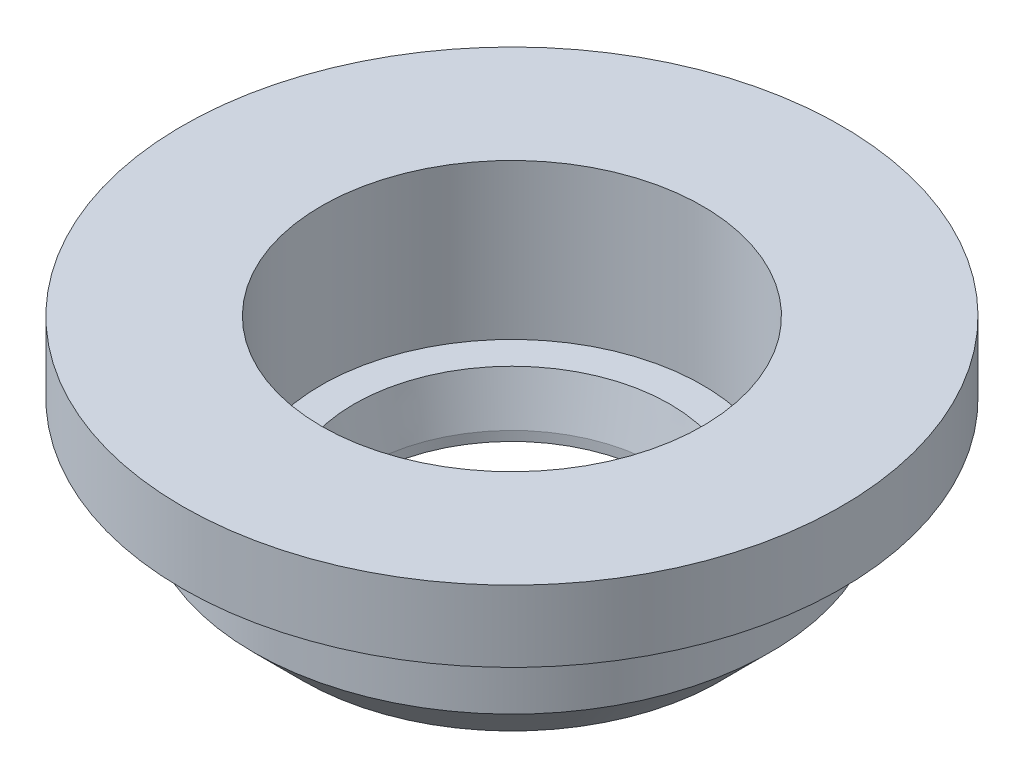
ISO-10303-21;
HEADER;
FILE_DESCRIPTION(('STEP AP214'),'2;1');
FILE_NAME('part.step','',(''),(''),'','','');
FILE_SCHEMA(('AUTOMOTIVE_DESIGN { 1 0 10303 214 1 1 1 1 }'));
ENDSEC;
DATA;
#1=APPLICATION_CONTEXT('core data for automotive mechanical design processes');
#2=APPLICATION_PROTOCOL_DEFINITION('international standard','automotive_design',2000,#1);
#3=PRODUCT_CONTEXT('',#1,'mechanical');
#4=PRODUCT('Part','Part','',(#3));
#5=PRODUCT_RELATED_PRODUCT_CATEGORY('part','',(#4));
#6=PRODUCT_DEFINITION_FORMATION('','',#4);
#7=PRODUCT_DEFINITION_CONTEXT('part definition',#1,'design');
#8=PRODUCT_DEFINITION('design','',#6,#7);
#9=PRODUCT_DEFINITION_SHAPE('','',#8);
#10=(LENGTH_UNIT() NAMED_UNIT(*) SI_UNIT(.MILLI.,.METRE.));
#11=(NAMED_UNIT(*) PLANE_ANGLE_UNIT() SI_UNIT($,.RADIAN.));
#12=(NAMED_UNIT(*) SI_UNIT($,.STERADIAN.) SOLID_ANGLE_UNIT());
#13=UNCERTAINTY_MEASURE_WITH_UNIT(LENGTH_MEASURE(1.E-05),#10,'distance_accuracy_value','');
#14=(GEOMETRIC_REPRESENTATION_CONTEXT(3) GLOBAL_UNCERTAINTY_ASSIGNED_CONTEXT((#13)) GLOBAL_UNIT_ASSIGNED_CONTEXT((#10,
#11,#12)) REPRESENTATION_CONTEXT('',''));
#15=CARTESIAN_POINT('',(0.,0.,0.));
#16=DIRECTION('',(0.,0.,1.));
#17=DIRECTION('',(1.,0.,0.));
#18=AXIS2_PLACEMENT_3D('',#15,#16,#17);
#19=CARTESIAN_POINT('',(0.,10.4485954216317,0.));
#20=DIRECTION('',(0.,1.,0.));
#21=DIRECTION('',(0.,0.,1.));
#22=AXIS2_PLACEMENT_3D('',#19,#20,#21);
#23=CYLINDRICAL_SURFACE('',#22,11.7475);
#24=CARTESIAN_POINT('',(0.,10.0707704216317,0.));
#25=DIRECTION('',(0.,1.,0.));
#26=DIRECTION('',(0.,0.,1.));
#27=AXIS2_PLACEMENT_3D('',#24,#25,#26);
#28=CIRCLE('',#27,11.7475);
#29=CARTESIAN_POINT('',(0.,10.0707704216317,11.7475));
#30=VERTEX_POINT('',#29);
#31=EDGE_CURVE('E11',#30,#30,#28,.T.);
#32=ORIENTED_EDGE('',*,*,#31,.F.);
#33=EDGE_LOOP('',(#32));
#34=FACE_BOUND('',#33,.T.);
#35=CARTESIAN_POINT('',(0.,7.53077042163169,0.));
#36=DIRECTION('',(0.,1.,0.));
#37=DIRECTION('',(0.,0.,1.));
#38=AXIS2_PLACEMENT_3D('',#35,#36,#37);
#39=CIRCLE('',#38,11.7475);
#40=CARTESIAN_POINT('',(0.,7.53077042163169,11.7475));
#41=VERTEX_POINT('',#40);
#42=EDGE_CURVE('E47',#41,#41,#39,.T.);
#43=ORIENTED_EDGE('',*,*,#42,.T.);
#44=EDGE_LOOP('',(#43));
#45=FACE_BOUND('',#44,.T.);
#46=ADVANCED_FACE('F40',(#34,#45),#23,.T.);
#47=CARTESIAN_POINT('',(9.2075,7.53077042163169,0.));
#48=DIRECTION('',(0.,1.,0.));
#49=DIRECTION('',(0.,0.,1.));
#50=AXIS2_PLACEMENT_3D('',#47,#48,#49);
#51=PLANE('',#50);
#52=ORIENTED_EDGE('',*,*,#42,.F.);
#53=EDGE_LOOP('',(#52));
#54=FACE_BOUND('',#53,.T.);
#55=CARTESIAN_POINT('',(0.,7.53077042163169,0.));
#56=DIRECTION('',(0.,1.,0.));
#57=DIRECTION('',(0.,0.,1.));
#58=AXIS2_PLACEMENT_3D('',#55,#56,#57);
#59=CIRCLE('',#58,9.2075);
#60=CARTESIAN_POINT('',(0.,7.53077042163169,9.2075));
#61=VERTEX_POINT('',#60);
#62=EDGE_CURVE('E54',#61,#61,#59,.T.);
#63=ORIENTED_EDGE('',*,*,#62,.T.);
#64=EDGE_LOOP('',(#63));
#65=FACE_BOUND('',#64,.T.);
#66=ADVANCED_FACE('F100',(#54,#65),#51,.F.);
#67=CARTESIAN_POINT('',(0.,10.4485954216317,0.));
#68=DIRECTION('',(0.,1.,0.));
#69=DIRECTION('',(0.,0.,1.));
#70=AXIS2_PLACEMENT_3D('',#67,#68,#69);
#71=CYLINDRICAL_SURFACE('',#70,9.2075);
#72=ORIENTED_EDGE('',*,*,#62,.F.);
#73=EDGE_LOOP('',(#72));
#74=FACE_BOUND('',#73,.T.);
#75=CARTESIAN_POINT('',(0.,4.29227042163169,0.));
#76=DIRECTION('',(0.,1.,0.));
#77=DIRECTION('',(0.,0.,1.));
#78=AXIS2_PLACEMENT_3D('',#75,#76,#77);
#79=CIRCLE('',#78,9.2075);
#80=CARTESIAN_POINT('',(0.,4.29227042163169,9.2075));
#81=VERTEX_POINT('',#80);
#82=EDGE_CURVE('E58',#81,#81,#79,.T.);
#83=ORIENTED_EDGE('',*,*,#82,.T.);
#84=EDGE_LOOP('',(#83));
#85=FACE_BOUND('',#84,.T.);
#86=ADVANCED_FACE('F105',(#74,#85),#71,.T.);
#87=CARTESIAN_POINT('',(0.,2.51427042163169,0.));
#88=DIRECTION('',(0.,1.,0.));
#89=DIRECTION('',(0.,0.,1.));
#90=AXIS2_PLACEMENT_3D('',#87,#88,#89);
#91=CONICAL_SURFACE('',#90,7.4295,0.785398163397448);
#92=ORIENTED_EDGE('',*,*,#82,.F.);
#93=EDGE_LOOP('',(#92));
#94=FACE_BOUND('',#93,.T.);
#95=CARTESIAN_POINT('',(0.,2.51427042163169,0.));
#96=DIRECTION('',(0.,1.,0.));
#97=DIRECTION('',(0.,0.,1.));
#98=AXIS2_PLACEMENT_3D('',#95,#96,#97);
#99=CIRCLE('',#98,7.4295);
#100=CARTESIAN_POINT('',(0.,2.51427042163169,7.4295));
#101=VERTEX_POINT('',#100);
#102=EDGE_CURVE('E63',#101,#101,#99,.T.);
#103=ORIENTED_EDGE('',*,*,#102,.T.);
#104=EDGE_LOOP('',(#103));
#105=FACE_BOUND('',#104,.T.);
#106=ADVANCED_FACE('F110',(#94,#105),#91,.T.);
#107=CARTESIAN_POINT('',(5.21399316922783,2.51427042163169,0.));
#108=DIRECTION('',(0.,1.,0.));
#109=DIRECTION('',(0.,0.,1.));
#110=AXIS2_PLACEMENT_3D('',#107,#108,#109);
#111=PLANE('',#110);
#112=ORIENTED_EDGE('',*,*,#102,.F.);
#113=EDGE_LOOP('',(#112));
#114=FACE_BOUND('',#113,.T.);
#115=CARTESIAN_POINT('',(0.,2.51427042163169,0.));
#116=DIRECTION('',(0.,1.,0.));
#117=DIRECTION('',(0.,0.,1.));
#118=AXIS2_PLACEMENT_3D('',#115,#116,#117);
#119=CIRCLE('',#118,5.21399316922783);
#120=CARTESIAN_POINT('',(0.,2.51427042163169,5.21399316922783));
#121=VERTEX_POINT('',#120);
#122=EDGE_CURVE('E67',#121,#121,#119,.T.);
#123=ORIENTED_EDGE('',*,*,#122,.T.);
#124=EDGE_LOOP('',(#123));
#125=FACE_BOUND('',#124,.T.);
#126=ADVANCED_FACE('F117',(#114,#125),#111,.F.);
#127=CARTESIAN_POINT('',(0.,10.4485954216317,0.));
#128=DIRECTION('',(0.,1.,0.));
#129=DIRECTION('',(0.,0.,1.));
#130=AXIS2_PLACEMENT_3D('',#127,#128,#129);
#131=CYLINDRICAL_SURFACE('',#130,5.21399316922783);
#132=ORIENTED_EDGE('',*,*,#122,.F.);
#133=EDGE_LOOP('',(#132));
#134=FACE_BOUND('',#133,.T.);
#135=CARTESIAN_POINT('',(0.,2.85494808961972,0.));
#136=DIRECTION('',(0.,1.,0.));
#137=DIRECTION('',(0.,0.,1.));
#138=AXIS2_PLACEMENT_3D('',#135,#136,#137);
#139=CIRCLE('',#138,5.21399316922783);
#140=CARTESIAN_POINT('',(0.,2.85494808961972,5.21399316922783));
#141=VERTEX_POINT('',#140);
#142=EDGE_CURVE('E71',#141,#141,#139,.T.);
#143=ORIENTED_EDGE('',*,*,#142,.T.);
#144=EDGE_LOOP('',(#143));
#145=FACE_BOUND('',#144,.T.);
#146=ADVANCED_FACE('F121',(#134,#145),#131,.F.);
#147=CARTESIAN_POINT('',(0.,4.54627042163169,0.));
#148=DIRECTION('',(0.,1.,0.));
#149=DIRECTION('',(0.,0.,1.));
#150=AXIS2_PLACEMENT_3D('',#147,#148,#149);
#151=CONICAL_SURFACE('',#150,5.62437008452973,0.238036608007879);
#152=ORIENTED_EDGE('',*,*,#142,.F.);
#153=EDGE_LOOP('',(#152));
#154=FACE_BOUND('',#153,.T.);
#155=CARTESIAN_POINT('',(0.,4.54627042163169,0.));
#156=DIRECTION('',(0.,1.,0.));
#157=DIRECTION('',(0.,0.,1.));
#158=AXIS2_PLACEMENT_3D('',#155,#156,#157);
#159=CIRCLE('',#158,5.62437008452973);
#160=CARTESIAN_POINT('',(0.,4.54627042163169,5.62437008452973));
#161=VERTEX_POINT('',#160);
#162=EDGE_CURVE('E75',#161,#161,#159,.T.);
#163=ORIENTED_EDGE('',*,*,#162,.T.);
#164=EDGE_LOOP('',(#163));
#165=FACE_BOUND('',#164,.T.);
#166=ADVANCED_FACE('F125',(#154,#165),#151,.F.);
#167=CARTESIAN_POINT('',(5.62437008452973,4.54627042163169,0.));
#168=DIRECTION('',(0.,-1.,0.));
#169=DIRECTION('',(0.,0.,-1.));
#170=AXIS2_PLACEMENT_3D('',#167,#168,#169);
#171=PLANE('',#170);
#172=ORIENTED_EDGE('',*,*,#162,.F.);
#173=EDGE_LOOP('',(#172));
#174=FACE_BOUND('',#173,.T.);
#175=CARTESIAN_POINT('',(0.,4.54627042163169,0.));
#176=DIRECTION('',(0.,1.,0.));
#177=DIRECTION('',(0.,0.,1.));
#178=AXIS2_PLACEMENT_3D('',#175,#176,#177);
#179=CIRCLE('',#178,6.7945);
#180=CARTESIAN_POINT('',(0.,4.54627042163169,6.7945));
#181=VERTEX_POINT('',#180);
#182=EDGE_CURVE('E79',#181,#181,#179,.T.);
#183=ORIENTED_EDGE('',*,*,#182,.T.);
#184=EDGE_LOOP('',(#183));
#185=FACE_BOUND('',#184,.T.);
#186=ADVANCED_FACE('F96',(#174,#185),#171,.F.);
#187=CARTESIAN_POINT('',(0.,10.4485954216317,0.));
#188=DIRECTION('',(0.,1.,0.));
#189=DIRECTION('',(0.,0.,1.));
#190=AXIS2_PLACEMENT_3D('',#187,#188,#189);
#191=CYLINDRICAL_SURFACE('',#190,6.7945);
#192=ORIENTED_EDGE('',*,*,#182,.F.);
#193=EDGE_LOOP('',(#192));
#194=FACE_BOUND('',#193,.T.);
#195=CARTESIAN_POINT('',(0.,10.0707704216317,0.));
#196=DIRECTION('',(0.,1.,0.));
#197=DIRECTION('',(0.,0.,1.));
#198=AXIS2_PLACEMENT_3D('',#195,#196,#197);
#199=CIRCLE('',#198,6.7945);
#200=CARTESIAN_POINT('',(0.,10.0707704216317,6.7945));
#201=VERTEX_POINT('',#200);
#202=EDGE_CURVE('E83',#201,#201,#199,.T.);
#203=ORIENTED_EDGE('',*,*,#202,.T.);
#204=EDGE_LOOP('',(#203));
#205=FACE_BOUND('',#204,.T.);
#206=ADVANCED_FACE('F88',(#194,#205),#191,.F.);
#207=CARTESIAN_POINT('',(6.7945,10.0707704216317,0.));
#208=DIRECTION('',(0.,-1.,0.));
#209=DIRECTION('',(0.,0.,-1.));
#210=AXIS2_PLACEMENT_3D('',#207,#208,#209);
#211=PLANE('',#210);
#212=ORIENTED_EDGE('',*,*,#202,.F.);
#213=EDGE_LOOP('',(#212));
#214=FACE_BOUND('',#213,.T.);
#215=ORIENTED_EDGE('',*,*,#31,.T.);
#216=EDGE_LOOP('',(#215));
#217=FACE_BOUND('',#216,.T.);
#218=ADVANCED_FACE('F90',(#214,#217),#211,.F.);
#219=CLOSED_SHELL('',(#46,#66,#86,#106,#126,#146,#166,#186,#206,#218));
#220=MANIFOLD_SOLID_BREP('B2',#219);
#221=ADVANCED_BREP_SHAPE_REPRESENTATION('',(#18,#220),#14);
#222=SHAPE_DEFINITION_REPRESENTATION(#9,#221);
ENDSEC;
END-ISO-10303-21;
